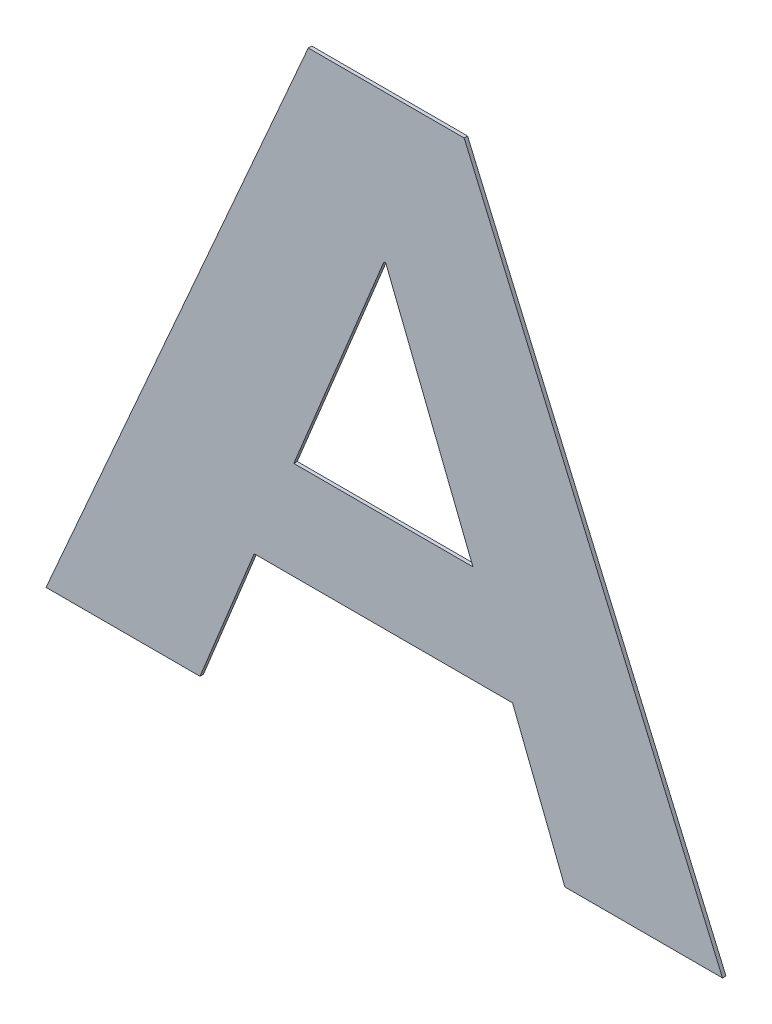
ISO-10303-21;
HEADER;
FILE_DESCRIPTION(('STEP AP214'),'2;1');
FILE_NAME('part.step','',(''),(''),'','','');
FILE_SCHEMA(('AUTOMOTIVE_DESIGN { 1 0 10303 214 1 1 1 1 }'));
ENDSEC;
DATA;
#1=APPLICATION_CONTEXT('core data for automotive mechanical design processes');
#2=APPLICATION_PROTOCOL_DEFINITION('international standard','automotive_design',2000,#1);
#3=PRODUCT_CONTEXT('',#1,'mechanical');
#4=PRODUCT('Part','Part','',(#3));
#5=PRODUCT_RELATED_PRODUCT_CATEGORY('part','',(#4));
#6=PRODUCT_DEFINITION_FORMATION('','',#4);
#7=PRODUCT_DEFINITION_CONTEXT('part definition',#1,'design');
#8=PRODUCT_DEFINITION('design','',#6,#7);
#9=PRODUCT_DEFINITION_SHAPE('','',#8);
#10=(LENGTH_UNIT() NAMED_UNIT(*) SI_UNIT(.MILLI.,.METRE.));
#11=(NAMED_UNIT(*) PLANE_ANGLE_UNIT() SI_UNIT($,.RADIAN.));
#12=(NAMED_UNIT(*) SI_UNIT($,.STERADIAN.) SOLID_ANGLE_UNIT());
#13=UNCERTAINTY_MEASURE_WITH_UNIT(LENGTH_MEASURE(1.E-05),#10,'distance_accuracy_value','');
#14=(GEOMETRIC_REPRESENTATION_CONTEXT(3) GLOBAL_UNCERTAINTY_ASSIGNED_CONTEXT((#13)) GLOBAL_UNIT_ASSIGNED_CONTEXT((#10,
#11,#12)) REPRESENTATION_CONTEXT('',''));
#15=CARTESIAN_POINT('',(0.,0.,0.));
#16=DIRECTION('',(0.,0.,1.));
#17=DIRECTION('',(1.,0.,0.));
#18=AXIS2_PLACEMENT_3D('',#15,#16,#17);
#19=CARTESIAN_POINT('',(0.1628746176759,0.7412429894471,0.0009));
#20=DIRECTION('',(0.,1.,0.));
#21=DIRECTION('',(0.,0.,1.));
#22=AXIS2_PLACEMENT_3D('',#19,#20,#21);
#23=PLANE('',#22);
#24=DIRECTION('',(0.,0.,1.));
#25=VECTOR('',#24,1.);
#26=CARTESIAN_POINT('',(0.1423547577759,0.7412429894471,0.));
#27=LINE('',#26,#25);
#28=CARTESIAN_POINT('',(0.1423547577759,0.7412429894471,0.));
#29=VERTEX_POINT('',#28);
#30=CARTESIAN_POINT('',(0.1423547577759,0.7412429894471,0.0009));
#31=VERTEX_POINT('',#30);
#32=EDGE_CURVE('E11',#29,#31,#27,.T.);
#33=ORIENTED_EDGE('',*,*,#32,.T.);
#34=DIRECTION('',(1.,0.,0.));
#35=VECTOR('',#34,1.);
#36=CARTESIAN_POINT('',(0.1423547577759,0.7412429894471,0.0009));
#37=LINE('',#36,#35);
#38=CARTESIAN_POINT('',(0.1833944775759,0.7412429894471,0.0009));
#39=VERTEX_POINT('',#38);
#40=EDGE_CURVE('E200',#31,#39,#37,.T.);
#41=ORIENTED_EDGE('',*,*,#40,.T.);
#42=DIRECTION('',(0.,0.,1.));
#43=VECTOR('',#42,1.);
#44=CARTESIAN_POINT('',(0.1833944775759,0.7412429894471,0.));
#45=LINE('',#44,#43);
#46=CARTESIAN_POINT('',(0.1833944775759,0.7412429894471,0.));
#47=VERTEX_POINT('',#46);
#48=EDGE_CURVE('E24',#47,#39,#45,.T.);
#49=ORIENTED_EDGE('',*,*,#48,.F.);
#50=DIRECTION('',(1.,0.,0.));
#51=VECTOR('',#50,1.);
#52=CARTESIAN_POINT('',(0.1423547577759,0.7412429894471,0.));
#53=LINE('',#52,#51);
#54=EDGE_CURVE('E188',#29,#47,#53,.T.);
#55=ORIENTED_EDGE('',*,*,#54,.F.);
#56=EDGE_LOOP('',(#33,#41,#49,#55));
#57=FACE_BOUND('',#56,.T.);
#58=ADVANCED_FACE('F17',(#57),#23,.T.);
#59=CARTESIAN_POINT('',(0.21742493402595,0.662452825082,0.0009));
#60=DIRECTION('',(0.918030838804518,0.3965089898147,0.));
#61=DIRECTION('',(0.,0.,-1.));
#62=AXIS2_PLACEMENT_3D('',#59,#60,#61);
#63=PLANE('',#62);
#64=ORIENTED_EDGE('',*,*,#48,.T.);
#65=DIRECTION('',(0.3965089898147,-0.918030838804518,0.));
#66=VECTOR('',#65,1.);
#67=CARTESIAN_POINT('',(0.1833944775759,0.7412429894471,0.0009));
#68=LINE('',#67,#66);
#69=CARTESIAN_POINT('',(0.251455390476,0.5836626607169,0.0009));
#70=VERTEX_POINT('',#69);
#71=EDGE_CURVE('E196',#39,#70,#68,.T.);
#72=ORIENTED_EDGE('',*,*,#71,.T.);
#73=DIRECTION('',(0.,0.,1.));
#74=VECTOR('',#73,1.);
#75=CARTESIAN_POINT('',(0.251455390476,0.5836626607169,0.));
#76=LINE('',#75,#74);
#77=CARTESIAN_POINT('',(0.251455390476,0.5836626607169,0.));
#78=VERTEX_POINT('',#77);
#79=EDGE_CURVE('E198',#78,#70,#76,.T.);
#80=ORIENTED_EDGE('',*,*,#79,.F.);
#81=DIRECTION('',(0.3965089898147,-0.918030838804518,0.));
#82=VECTOR('',#81,1.);
#83=CARTESIAN_POINT('',(0.1833944775759,0.7412429894471,0.));
#84=LINE('',#83,#82);
#85=EDGE_CURVE('E180',#47,#78,#84,.T.);
#86=ORIENTED_EDGE('',*,*,#85,.F.);
#87=EDGE_LOOP('',(#64,#72,#80,#86));
#88=FACE_BOUND('',#87,.T.);
#89=ADVANCED_FACE('F209',(#88),#63,.T.);
#90=CARTESIAN_POINT('',(0.23069173502595,0.5836626607169,0.0009));
#91=DIRECTION('',(0.,-1.,0.));
#92=DIRECTION('',(0.,0.,-1.));
#93=AXIS2_PLACEMENT_3D('',#90,#91,#92);
#94=PLANE('',#93);
#95=ORIENTED_EDGE('',*,*,#79,.T.);
#96=DIRECTION('',(-1.,0.,0.));
#97=VECTOR('',#96,1.);
#98=CARTESIAN_POINT('',(0.251455390476,0.5836626607169,0.0009));
#99=LINE('',#98,#97);
#100=CARTESIAN_POINT('',(0.2099280795759,0.5836626607169,0.0009));
#101=VERTEX_POINT('',#100);
#102=EDGE_CURVE('E191',#70,#101,#99,.T.);
#103=ORIENTED_EDGE('',*,*,#102,.T.);
#104=DIRECTION('',(0.,0.,1.));
#105=VECTOR('',#104,1.);
#106=CARTESIAN_POINT('',(0.2099280795759,0.5836626607169,0.));
#107=LINE('',#106,#105);
#108=CARTESIAN_POINT('',(0.2099280795759,0.5836626607169,0.));
#109=VERTEX_POINT('',#108);
#110=EDGE_CURVE('E194',#109,#101,#107,.T.);
#111=ORIENTED_EDGE('',*,*,#110,.F.);
#112=DIRECTION('',(-1.,0.,0.));
#113=VECTOR('',#112,1.);
#114=CARTESIAN_POINT('',(0.251455390476,0.5836626607169,0.));
#115=LINE('',#114,#113);
#116=EDGE_CURVE('E172',#78,#109,#115,.T.);
#117=ORIENTED_EDGE('',*,*,#116,.F.);
#118=EDGE_LOOP('',(#95,#103,#111,#117));
#119=FACE_BOUND('',#118,.T.);
#120=ADVANCED_FACE('F212',(#119),#94,.T.);
#121=CARTESIAN_POINT('',(0.20304071717595,0.601210187852,0.0009));
#122=DIRECTION('',(-0.930865350415299,-0.365362421981521,0.));
#123=DIRECTION('',(0.,0.,1.));
#124=AXIS2_PLACEMENT_3D('',#121,#122,#123);
#125=PLANE('',#124);
#126=ORIENTED_EDGE('',*,*,#110,.T.);
#127=DIRECTION('',(-0.365362421981521,0.930865350415299,0.));
#128=VECTOR('',#127,1.);
#129=CARTESIAN_POINT('',(0.2099280795759,0.5836626607169,0.0009));
#130=LINE('',#129,#128);
#131=CARTESIAN_POINT('',(0.196153354776,0.6187577149871,0.0009));
#132=VERTEX_POINT('',#131);
#133=EDGE_CURVE('E183',#101,#132,#130,.T.);
#134=ORIENTED_EDGE('',*,*,#133,.T.);
#135=DIRECTION('',(0.,0.,1.));
#136=VECTOR('',#135,1.);
#137=CARTESIAN_POINT('',(0.196153354776,0.6187577149871,0.));
#138=LINE('',#137,#136);
#139=CARTESIAN_POINT('',(0.196153354776,0.6187577149871,0.));
#140=VERTEX_POINT('',#139);
#141=EDGE_CURVE('E186',#140,#132,#138,.T.);
#142=ORIENTED_EDGE('',*,*,#141,.F.);
#143=DIRECTION('',(-0.365362421981521,0.930865350415299,0.));
#144=VECTOR('',#143,1.);
#145=CARTESIAN_POINT('',(0.2099280795759,0.5836626607169,0.));
#146=LINE('',#145,#144);
#147=EDGE_CURVE('E164',#109,#140,#146,.T.);
#148=ORIENTED_EDGE('',*,*,#147,.F.);
#149=EDGE_LOOP('',(#126,#134,#142,#148));
#150=FACE_BOUND('',#149,.T.);
#151=ADVANCED_FACE('F231',(#150),#125,.T.);
#152=CARTESIAN_POINT('',(0.16212289832595,0.6187577149871,0.0009));
#153=DIRECTION('',(0.,-1.,0.));
#154=DIRECTION('',(0.,0.,-1.));
#155=AXIS2_PLACEMENT_3D('',#152,#153,#154);
#156=PLANE('',#155);
#157=ORIENTED_EDGE('',*,*,#141,.T.);
#158=DIRECTION('',(-1.,0.,0.));
#159=VECTOR('',#158,1.);
#160=CARTESIAN_POINT('',(0.196153354776,0.6187577149871,0.0009));
#161=LINE('',#160,#159);
#162=CARTESIAN_POINT('',(0.1280924418759,0.6187577149871,0.0009));
#163=VERTEX_POINT('',#162);
#164=EDGE_CURVE('E175',#132,#163,#161,.T.);
#165=ORIENTED_EDGE('',*,*,#164,.T.);
#166=DIRECTION('',(0.,0.,1.));
#167=VECTOR('',#166,1.);
#168=CARTESIAN_POINT('',(0.1280924418759,0.6187577149871,0.));
#169=LINE('',#168,#167);
#170=CARTESIAN_POINT('',(0.1280924418759,0.6187577149871,0.));
#171=VERTEX_POINT('',#170);
#172=EDGE_CURVE('E178',#171,#163,#169,.T.);
#173=ORIENTED_EDGE('',*,*,#172,.F.);
#174=DIRECTION('',(-1.,0.,0.));
#175=VECTOR('',#174,1.);
#176=CARTESIAN_POINT('',(0.196153354776,0.6187577149871,0.));
#177=LINE('',#176,#175);
#178=EDGE_CURVE('E156',#140,#171,#177,.T.);
#179=ORIENTED_EDGE('',*,*,#178,.F.);
#180=EDGE_LOOP('',(#157,#165,#173,#179));
#181=FACE_BOUND('',#180,.T.);
#182=ADVANCED_FACE('F229',(#181),#156,.T.);
#183=CARTESIAN_POINT('',(0.1209612839259,0.601210187852,0.0009));
#184=DIRECTION('',(0.926421005522081,-0.37648920373293,0.));
#185=DIRECTION('',(0.,0.,-1.));
#186=AXIS2_PLACEMENT_3D('',#183,#184,#185);
#187=PLANE('',#186);
#188=ORIENTED_EDGE('',*,*,#172,.T.);
#189=DIRECTION('',(-0.37648920373293,-0.926421005522081,0.));
#190=VECTOR('',#189,1.);
#191=CARTESIAN_POINT('',(0.1280924418759,0.6187577149871,0.0009));
#192=LINE('',#191,#190);
#193=CARTESIAN_POINT('',(0.1138301259759,0.5836626607169,0.0009));
#194=VERTEX_POINT('',#193);
#195=EDGE_CURVE('E167',#163,#194,#192,.T.);
#196=ORIENTED_EDGE('',*,*,#195,.T.);
#197=DIRECTION('',(0.,0.,1.));
#198=VECTOR('',#197,1.);
#199=CARTESIAN_POINT('',(0.1138301259759,0.5836626607169,0.));
#200=LINE('',#199,#198);
#201=CARTESIAN_POINT('',(0.1138301259759,0.5836626607169,0.));
#202=VERTEX_POINT('',#201);
#203=EDGE_CURVE('E170',#202,#194,#200,.T.);
#204=ORIENTED_EDGE('',*,*,#203,.F.);
#205=DIRECTION('',(-0.37648920373293,-0.926421005522081,0.));
#206=VECTOR('',#205,1.);
#207=CARTESIAN_POINT('',(0.1280924418759,0.6187577149871,0.));
#208=LINE('',#207,#206);
#209=EDGE_CURVE('E150',#171,#202,#208,.T.);
#210=ORIENTED_EDGE('',*,*,#209,.F.);
#211=EDGE_LOOP('',(#188,#196,#204,#210));
#212=FACE_BOUND('',#211,.T.);
#213=ADVANCED_FACE('F226',(#212),#187,.T.);
#214=CARTESIAN_POINT('',(0.0935540616259499,0.5836626607169,0.0009));
#215=DIRECTION('',(0.,-1.,0.));
#216=DIRECTION('',(0.,0.,-1.));
#217=AXIS2_PLACEMENT_3D('',#214,#215,#216);
#218=PLANE('',#217);
#219=ORIENTED_EDGE('',*,*,#203,.T.);
#220=DIRECTION('',(-1.,0.,0.));
#221=VECTOR('',#220,1.);
#222=CARTESIAN_POINT('',(0.1138301259759,0.5836626607169,0.0009));
#223=LINE('',#222,#221);
#224=CARTESIAN_POINT('',(0.0732779972759999,0.5836626607169,0.0009));
#225=VERTEX_POINT('',#224);
#226=EDGE_CURVE('E159',#194,#225,#223,.T.);
#227=ORIENTED_EDGE('',*,*,#226,.T.);
#228=DIRECTION('',(0.,0.,1.));
#229=VECTOR('',#228,1.);
#230=CARTESIAN_POINT('',(0.0732779972759999,0.5836626607169,0.));
#231=LINE('',#230,#229);
#232=CARTESIAN_POINT('',(0.0732779972759999,0.5836626607169,0.));
#233=VERTEX_POINT('',#232);
#234=EDGE_CURVE('E162',#233,#225,#231,.T.);
#235=ORIENTED_EDGE('',*,*,#234,.F.);
#236=DIRECTION('',(-1.,0.,0.));
#237=VECTOR('',#236,1.);
#238=CARTESIAN_POINT('',(0.1138301259759,0.5836626607169,0.));
#239=LINE('',#238,#237);
#240=EDGE_CURVE('E142',#202,#233,#239,.T.);
#241=ORIENTED_EDGE('',*,*,#240,.F.);
#242=EDGE_LOOP('',(#219,#227,#235,#241));
#243=FACE_BOUND('',#242,.T.);
#244=ADVANCED_FACE('F222',(#243),#218,.T.);
#245=CARTESIAN_POINT('',(0.10781637752595,0.662452825082,0.0009));
#246=DIRECTION('',(-0.915868187999154,0.401479093118367,0.));
#247=DIRECTION('',(0.,0.,1.));
#248=AXIS2_PLACEMENT_3D('',#245,#246,#247);
#249=PLANE('',#248);
#250=ORIENTED_EDGE('',*,*,#234,.T.);
#251=DIRECTION('',(0.401479093118367,0.915868187999154,0.));
#252=VECTOR('',#251,1.);
#253=CARTESIAN_POINT('',(0.0732779972759999,0.5836626607169,0.0009));
#254=LINE('',#253,#252);
#255=EDGE_CURVE('E153',#225,#31,#254,.T.);
#256=ORIENTED_EDGE('',*,*,#255,.T.);
#257=ORIENTED_EDGE('',*,*,#32,.F.);
#258=DIRECTION('',(0.401479093118367,0.915868187999154,0.));
#259=VECTOR('',#258,1.);
#260=CARTESIAN_POINT('',(0.0732779972759999,0.5836626607169,0.));
#261=LINE('',#260,#259);
#262=EDGE_CURVE('E114',#233,#29,#261,.T.);
#263=ORIENTED_EDGE('',*,*,#262,.F.);
#264=EDGE_LOOP('',(#250,#256,#257,#263));
#265=FACE_BOUND('',#264,.T.);
#266=ADVANCED_FACE('F217',(#265),#249,.T.);
#267=CARTESIAN_POINT('',(0.16212289832595,0.644576167286999,0.0009));
#268=DIRECTION('',(0.,1.,0.));
#269=DIRECTION('',(0.,0.,1.));
#270=AXIS2_PLACEMENT_3D('',#267,#268,#269);
#271=PLANE('',#270);
#272=DIRECTION('',(0.,0.,1.));
#273=VECTOR('',#272,1.);
#274=CARTESIAN_POINT('',(0.138535220076,0.644576167286999,0.));
#275=LINE('',#274,#273);
#276=CARTESIAN_POINT('',(0.138535220076,0.644576167286999,0.));
#277=VERTEX_POINT('',#276);
#278=CARTESIAN_POINT('',(0.138535220076,0.644576167286999,0.0009));
#279=VERTEX_POINT('',#278);
#280=EDGE_CURVE('E120',#277,#279,#275,.T.);
#281=ORIENTED_EDGE('',*,*,#280,.T.);
#282=DIRECTION('',(1.,0.,0.));
#283=VECTOR('',#282,1.);
#284=CARTESIAN_POINT('',(0.138535220076,0.644576167286999,0.0009));
#285=LINE('',#284,#283);
#286=CARTESIAN_POINT('',(0.1857105765759,0.644576167286999,0.0009));
#287=VERTEX_POINT('',#286);
#288=EDGE_CURVE('E145',#279,#287,#285,.T.);
#289=ORIENTED_EDGE('',*,*,#288,.T.);
#290=DIRECTION('',(0.,0.,1.));
#291=VECTOR('',#290,1.);
#292=CARTESIAN_POINT('',(0.1857105765759,0.644576167286999,0.));
#293=LINE('',#292,#291);
#294=CARTESIAN_POINT('',(0.1857105765759,0.644576167286999,0.));
#295=VERTEX_POINT('',#294);
#296=EDGE_CURVE('E148',#295,#287,#293,.T.);
#297=ORIENTED_EDGE('',*,*,#296,.F.);
#298=DIRECTION('',(1.,0.,0.));
#299=VECTOR('',#298,1.);
#300=CARTESIAN_POINT('',(0.138535220076,0.644576167286999,0.));
#301=LINE('',#300,#299);
#302=EDGE_CURVE('E132',#277,#295,#301,.T.);
#303=ORIENTED_EDGE('',*,*,#302,.F.);
#304=EDGE_LOOP('',(#281,#289,#297,#303));
#305=FACE_BOUND('',#304,.T.);
#306=ADVANCED_FACE('F250',(#305),#271,.T.);
#307=CARTESIAN_POINT('',(0.174231643476,0.673486820031998,0.0009));
#308=DIRECTION('',(-0.929419584354608,-0.369024709495323,0.));
#309=DIRECTION('',(0.,0.,1.));
#310=AXIS2_PLACEMENT_3D('',#307,#308,#309);
#311=PLANE('',#310);
#312=ORIENTED_EDGE('',*,*,#296,.T.);
#313=DIRECTION('',(-0.369024709495323,0.929419584354608,0.));
#314=VECTOR('',#313,1.);
#315=CARTESIAN_POINT('',(0.1857105765759,0.644576167286999,0.0009));
#316=LINE('',#315,#314);
#317=CARTESIAN_POINT('',(0.1627527103761,0.702397472776997,0.0009));
#318=VERTEX_POINT('',#317);
#319=EDGE_CURVE('E137',#287,#318,#316,.T.);
#320=ORIENTED_EDGE('',*,*,#319,.T.);
#321=DIRECTION('',(0.,1.2335811384724E-13,1.));
#322=VECTOR('',#321,1.);
#323=CARTESIAN_POINT('',(0.1627527103761,0.702397472776997,0.));
#324=LINE('',#323,#322);
#325=CARTESIAN_POINT('',(0.1627527103761,0.702397472776997,0.));
#326=VERTEX_POINT('',#325);
#327=EDGE_CURVE('E140',#326,#318,#324,.T.);
#328=ORIENTED_EDGE('',*,*,#327,.F.);
#329=DIRECTION('',(-0.369024709495323,0.929419584354608,0.));
#330=VECTOR('',#329,1.);
#331=CARTESIAN_POINT('',(0.1857105765759,0.644576167286999,0.));
#332=LINE('',#331,#330);
#333=EDGE_CURVE('E126',#295,#326,#332,.T.);
#334=ORIENTED_EDGE('',*,*,#333,.F.);
#335=EDGE_LOOP('',(#312,#320,#328,#334));
#336=FACE_BOUND('',#335,.T.);
#337=ADVANCED_FACE('F267',(#336),#311,.T.);
#338=CARTESIAN_POINT('',(0.16250891482605,0.702397472776997,0.0009));
#339=DIRECTION('',(0.,-1.,0.));
#340=DIRECTION('',(0.,0.,-1.));
#341=AXIS2_PLACEMENT_3D('',#338,#339,#340);
#342=PLANE('',#341);
#343=ORIENTED_EDGE('',*,*,#327,.T.);
#344=DIRECTION('',(-1.,0.,0.));
#345=VECTOR('',#344,1.);
#346=CARTESIAN_POINT('',(0.1627527103761,0.702397472776997,0.0009));
#347=LINE('',#346,#345);
#348=CARTESIAN_POINT('',(0.162265119276,0.702397472776997,0.0009));
#349=VERTEX_POINT('',#348);
#350=EDGE_CURVE('E110',#318,#349,#347,.T.);
#351=ORIENTED_EDGE('',*,*,#350,.T.);
#352=DIRECTION('',(0.,1.2335811384724E-13,1.));
#353=VECTOR('',#352,1.);
#354=CARTESIAN_POINT('',(0.162265119276,0.702397472776997,0.));
#355=LINE('',#354,#353);
#356=CARTESIAN_POINT('',(0.162265119276,0.702397472776997,0.));
#357=VERTEX_POINT('',#356);
#358=EDGE_CURVE('E103',#357,#349,#355,.T.);
#359=ORIENTED_EDGE('',*,*,#358,.F.);
#360=DIRECTION('',(-1.,0.,0.));
#361=VECTOR('',#360,1.);
#362=CARTESIAN_POINT('',(0.1627527103761,0.702397472776997,0.));
#363=LINE('',#362,#361);
#364=EDGE_CURVE('E107',#326,#357,#363,.T.);
#365=ORIENTED_EDGE('',*,*,#364,.F.);
#366=EDGE_LOOP('',(#343,#351,#359,#365));
#367=FACE_BOUND('',#366,.T.);
#368=ADVANCED_FACE('F105',(#367),#342,.T.);
#369=CARTESIAN_POINT('',(0.150400169676,0.673486820031998,0.0009));
#370=DIRECTION('',(0.925121765742887,-0.379670539479642,0.));
#371=DIRECTION('',(0.,0.,-1.));
#372=AXIS2_PLACEMENT_3D('',#369,#370,#371);
#373=PLANE('',#372);
#374=ORIENTED_EDGE('',*,*,#358,.T.);
#375=DIRECTION('',(-0.379670539479642,-0.925121765742887,0.));
#376=VECTOR('',#375,1.);
#377=CARTESIAN_POINT('',(0.162265119276,0.702397472776997,0.0009));
#378=LINE('',#377,#376);
#379=EDGE_CURVE('E128',#349,#279,#378,.T.);
#380=ORIENTED_EDGE('',*,*,#379,.T.);
#381=ORIENTED_EDGE('',*,*,#280,.F.);
#382=DIRECTION('',(-0.379670539479642,-0.925121765742887,0.));
#383=VECTOR('',#382,1.);
#384=CARTESIAN_POINT('',(0.162265119276,0.702397472776997,0.));
#385=LINE('',#384,#383);
#386=EDGE_CURVE('E118',#357,#277,#385,.T.);
#387=ORIENTED_EDGE('',*,*,#386,.F.);
#388=EDGE_LOOP('',(#374,#380,#381,#387));
#389=FACE_BOUND('',#388,.T.);
#390=ADVANCED_FACE('F119',(#389),#373,.T.);
#391=CARTESIAN_POINT('',(0.162366693876,0.5836626607169,0.));
#392=DIRECTION('',(0.,0.,1.));
#393=DIRECTION('',(1.,0.,0.));
#394=AXIS2_PLACEMENT_3D('',#391,#392,#393);
#395=PLANE('',#394);
#396=ORIENTED_EDGE('',*,*,#54,.T.);
#397=ORIENTED_EDGE('',*,*,#85,.T.);
#398=ORIENTED_EDGE('',*,*,#116,.T.);
#399=ORIENTED_EDGE('',*,*,#147,.T.);
#400=ORIENTED_EDGE('',*,*,#178,.T.);
#401=ORIENTED_EDGE('',*,*,#209,.T.);
#402=ORIENTED_EDGE('',*,*,#240,.T.);
#403=ORIENTED_EDGE('',*,*,#262,.T.);
#404=EDGE_LOOP('',(#396,#397,#398,#399,#400,#401,#402,#403));
#405=FACE_BOUND('',#404,.T.);
#406=ORIENTED_EDGE('',*,*,#302,.T.);
#407=ORIENTED_EDGE('',*,*,#333,.T.);
#408=ORIENTED_EDGE('',*,*,#364,.T.);
#409=ORIENTED_EDGE('',*,*,#386,.T.);
#410=EDGE_LOOP('',(#406,#407,#408,#409));
#411=FACE_BOUND('',#410,.T.);
#412=ADVANCED_FACE('F124',(#405,#411),#395,.F.);
#413=CARTESIAN_POINT('',(0.162366693876,0.5836626607169,0.0009));
#414=DIRECTION('',(0.,0.,1.));
#415=DIRECTION('',(1.,0.,0.));
#416=AXIS2_PLACEMENT_3D('',#413,#414,#415);
#417=PLANE('',#416);
#418=ORIENTED_EDGE('',*,*,#40,.F.);
#419=ORIENTED_EDGE('',*,*,#255,.F.);
#420=ORIENTED_EDGE('',*,*,#226,.F.);
#421=ORIENTED_EDGE('',*,*,#195,.F.);
#422=ORIENTED_EDGE('',*,*,#164,.F.);
#423=ORIENTED_EDGE('',*,*,#133,.F.);
#424=ORIENTED_EDGE('',*,*,#102,.F.);
#425=ORIENTED_EDGE('',*,*,#71,.F.);
#426=EDGE_LOOP('',(#418,#419,#420,#421,#422,#423,#424,#425));
#427=FACE_BOUND('',#426,.T.);
#428=ORIENTED_EDGE('',*,*,#288,.F.);
#429=ORIENTED_EDGE('',*,*,#379,.F.);
#430=ORIENTED_EDGE('',*,*,#350,.F.);
#431=ORIENTED_EDGE('',*,*,#319,.F.);
#432=EDGE_LOOP('',(#428,#429,#430,#431));
#433=FACE_BOUND('',#432,.T.);
#434=ADVANCED_FACE('F206',(#427,#433),#417,.T.);
#435=CLOSED_SHELL('',(#58,#89,#120,#151,#182,#213,#244,#266,#306,#337,#368,#390,#412,#434));
#436=MANIFOLD_SOLID_BREP('B1',#435);
#437=ADVANCED_BREP_SHAPE_REPRESENTATION('',(#18,#436),#14);
#438=SHAPE_DEFINITION_REPRESENTATION(#9,#437);
ENDSEC;
END-ISO-10303-21;
